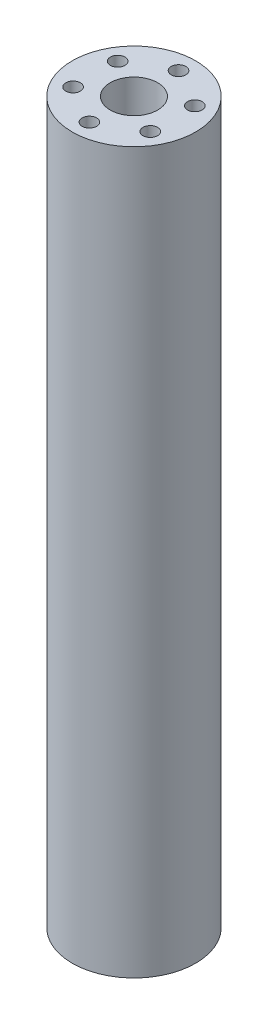
ISO-10303-21;
HEADER;
FILE_DESCRIPTION(('STEP AP214'),'2;1');
FILE_NAME('part.step','',(''),(''),'','','');
FILE_SCHEMA(('AUTOMOTIVE_DESIGN { 1 0 10303 214 1 1 1 1 }'));
ENDSEC;
DATA;
#1=APPLICATION_CONTEXT('core data for automotive mechanical design processes');
#2=APPLICATION_PROTOCOL_DEFINITION('international standard','automotive_design',2000,#1);
#3=PRODUCT_CONTEXT('',#1,'mechanical');
#4=PRODUCT('Part','Part','',(#3));
#5=PRODUCT_RELATED_PRODUCT_CATEGORY('part','',(#4));
#6=PRODUCT_DEFINITION_FORMATION('','',#4);
#7=PRODUCT_DEFINITION_CONTEXT('part definition',#1,'design');
#8=PRODUCT_DEFINITION('design','',#6,#7);
#9=PRODUCT_DEFINITION_SHAPE('','',#8);
#10=(LENGTH_UNIT() NAMED_UNIT(*) SI_UNIT(.MILLI.,.METRE.));
#11=(NAMED_UNIT(*) PLANE_ANGLE_UNIT() SI_UNIT($,.RADIAN.));
#12=(NAMED_UNIT(*) SI_UNIT($,.STERADIAN.) SOLID_ANGLE_UNIT());
#13=UNCERTAINTY_MEASURE_WITH_UNIT(LENGTH_MEASURE(1.E-05),#10,'distance_accuracy_value','');
#14=(GEOMETRIC_REPRESENTATION_CONTEXT(3) GLOBAL_UNCERTAINTY_ASSIGNED_CONTEXT((#13)) GLOBAL_UNIT_ASSIGNED_CONTEXT((#10,
#11,#12)) REPRESENTATION_CONTEXT('',''));
#15=CARTESIAN_POINT('',(0.,0.,0.));
#16=DIRECTION('',(0.,0.,1.));
#17=DIRECTION('',(1.,0.,0.));
#18=AXIS2_PLACEMENT_3D('',#15,#16,#17);
#19=CARTESIAN_POINT('',(0.,210.,0.));
#20=DIRECTION('',(0.,1.,0.));
#21=DIRECTION('',(0.,0.,1.));
#22=AXIS2_PLACEMENT_3D('',#19,#20,#21);
#23=PLANE('',#22);
#24=CARTESIAN_POINT('',(-11.2583302491969,210.,6.50000000000048));
#25=DIRECTION('',(0.,1.,0.));
#26=DIRECTION('',(0.,0.,1.));
#27=AXIS2_PLACEMENT_3D('',#24,#25,#26);
#28=CIRCLE('',#27,2.12769231000105);
#29=CARTESIAN_POINT('',(-11.2583302491969,210.,8.62769231000153));
#30=VERTEX_POINT('',#29);
#31=EDGE_CURVE('E75',#30,#30,#28,.T.);
#32=ORIENTED_EDGE('',*,*,#31,.F.);
#33=EDGE_LOOP('',(#32));
#34=FACE_BOUND('',#33,.T.);
#35=CARTESIAN_POINT('',(11.2583302491985,210.,6.49999999999952));
#36=DIRECTION('',(0.,1.,0.));
#37=DIRECTION('',(0.,0.,1.));
#38=AXIS2_PLACEMENT_3D('',#35,#36,#37);
#39=CIRCLE('',#38,2.12769231000071);
#40=CARTESIAN_POINT('',(11.2583302491985,210.,8.62769231000023));
#41=VERTEX_POINT('',#40);
#42=EDGE_CURVE('E63',#41,#41,#39,.T.);
#43=ORIENTED_EDGE('',*,*,#42,.F.);
#44=EDGE_LOOP('',(#43));
#45=FACE_BOUND('',#44,.T.);
#46=CARTESIAN_POINT('',(0.,210.,0.));
#47=DIRECTION('',(0.,1.,0.));
#48=DIRECTION('',(0.,0.,1.));
#49=AXIS2_PLACEMENT_3D('',#46,#47,#48);
#50=CIRCLE('',#49,6.9156293);
#51=CARTESIAN_POINT('',(0.,210.,6.9156293));
#52=VERTEX_POINT('',#51);
#53=EDGE_CURVE('E51',#52,#52,#50,.T.);
#54=ORIENTED_EDGE('',*,*,#53,.F.);
#55=EDGE_LOOP('',(#54));
#56=FACE_BOUND('',#55,.T.);
#57=CARTESIAN_POINT('',(0.,210.,0.));
#58=DIRECTION('',(0.,1.,0.));
#59=DIRECTION('',(0.,0.,1.));
#60=AXIS2_PLACEMENT_3D('',#57,#58,#59);
#61=CIRCLE('',#60,18.);
#62=CARTESIAN_POINT('',(0.,210.,18.));
#63=VERTEX_POINT('',#62);
#64=EDGE_CURVE('E10',#63,#63,#61,.T.);
#65=ORIENTED_EDGE('',*,*,#64,.T.);
#66=EDGE_LOOP('',(#65));
#67=FACE_BOUND('',#66,.T.);
#68=CARTESIAN_POINT('',(0.,210.,-13.));
#69=DIRECTION('',(0.,1.,0.));
#70=DIRECTION('',(0.,0.,1.));
#71=AXIS2_PLACEMENT_3D('',#68,#69,#70);
#72=CIRCLE('',#71,2.12769231);
#73=CARTESIAN_POINT('',(0.,210.,-10.87230769));
#74=VERTEX_POINT('',#73);
#75=EDGE_CURVE('E46',#74,#74,#72,.T.);
#76=ORIENTED_EDGE('',*,*,#75,.F.);
#77=EDGE_LOOP('',(#76));
#78=FACE_BOUND('',#77,.T.);
#79=CARTESIAN_POINT('',(11.258330249198,210.,-6.50000000000048));
#80=DIRECTION('',(0.,1.,0.));
#81=DIRECTION('',(0.,0.,1.));
#82=AXIS2_PLACEMENT_3D('',#79,#80,#81);
#83=CIRCLE('',#82,2.12769231000016);
#84=CARTESIAN_POINT('',(11.258330249198,210.,-4.37230769000032));
#85=VERTEX_POINT('',#84);
#86=EDGE_CURVE('E57',#85,#85,#83,.T.);
#87=ORIENTED_EDGE('',*,*,#86,.F.);
#88=EDGE_LOOP('',(#87));
#89=FACE_BOUND('',#88,.T.);
#90=CARTESIAN_POINT('',(1.10526258610797E-12,210.,13.));
#91=DIRECTION('',(0.,1.,0.));
#92=DIRECTION('',(0.,0.,1.));
#93=AXIS2_PLACEMENT_3D('',#90,#91,#92);
#94=CIRCLE('',#93,2.12769231000114);
#95=CARTESIAN_POINT('',(1.10526258610797E-12,210.,15.1276923100011));
#96=VERTEX_POINT('',#95);
#97=EDGE_CURVE('E69',#96,#96,#94,.T.);
#98=ORIENTED_EDGE('',*,*,#97,.F.);
#99=EDGE_LOOP('',(#98));
#100=FACE_BOUND('',#99,.T.);
#101=CARTESIAN_POINT('',(-11.2583302491974,210.,-6.49999999999951));
#102=DIRECTION('',(0.,1.,0.));
#103=DIRECTION('',(0.,0.,1.));
#104=AXIS2_PLACEMENT_3D('',#101,#102,#103);
#105=CIRCLE('',#104,2.12769231000056);
#106=CARTESIAN_POINT('',(-11.2583302491974,210.,-4.37230768999895));
#107=VERTEX_POINT('',#106);
#108=EDGE_CURVE('E81',#107,#107,#105,.T.);
#109=ORIENTED_EDGE('',*,*,#108,.F.);
#110=EDGE_LOOP('',(#109));
#111=FACE_BOUND('',#110,.T.);
#112=ADVANCED_FACE('F35',(#34,#45,#56,#67,#78,#89,#100,#111),#23,.T.);
#113=CARTESIAN_POINT('',(0.,0.,0.));
#114=DIRECTION('',(0.,1.,0.));
#115=DIRECTION('',(0.,0.,1.));
#116=AXIS2_PLACEMENT_3D('',#113,#114,#115);
#117=PLANE('',#116);
#118=CARTESIAN_POINT('',(0.,0.,0.));
#119=DIRECTION('',(0.,1.,0.));
#120=DIRECTION('',(0.,0.,1.));
#121=AXIS2_PLACEMENT_3D('',#118,#119,#120);
#122=CIRCLE('',#121,18.);
#123=CARTESIAN_POINT('',(0.,0.,18.));
#124=VERTEX_POINT('',#123);
#125=EDGE_CURVE('E39',#124,#124,#122,.T.);
#126=ORIENTED_EDGE('',*,*,#125,.F.);
#127=EDGE_LOOP('',(#126));
#128=FACE_BOUND('',#127,.T.);
#129=CARTESIAN_POINT('',(0.,0.,-13.));
#130=DIRECTION('',(0.,1.,0.));
#131=DIRECTION('',(0.,0.,1.));
#132=AXIS2_PLACEMENT_3D('',#129,#130,#131);
#133=CIRCLE('',#132,2.12769231);
#134=CARTESIAN_POINT('',(0.,0.,-10.87230769));
#135=VERTEX_POINT('',#134);
#136=EDGE_CURVE('E48',#135,#135,#133,.T.);
#137=ORIENTED_EDGE('',*,*,#136,.T.);
#138=EDGE_LOOP('',(#137));
#139=FACE_BOUND('',#138,.T.);
#140=CARTESIAN_POINT('',(0.,0.,0.));
#141=DIRECTION('',(0.,1.,0.));
#142=DIRECTION('',(0.,0.,1.));
#143=AXIS2_PLACEMENT_3D('',#140,#141,#142);
#144=CIRCLE('',#143,6.9156293);
#145=CARTESIAN_POINT('',(0.,0.,6.9156293));
#146=VERTEX_POINT('',#145);
#147=EDGE_CURVE('E54',#146,#146,#144,.T.);
#148=ORIENTED_EDGE('',*,*,#147,.T.);
#149=EDGE_LOOP('',(#148));
#150=FACE_BOUND('',#149,.T.);
#151=CARTESIAN_POINT('',(11.258330249198,0.,-6.50000000000048));
#152=DIRECTION('',(0.,1.,0.));
#153=DIRECTION('',(0.,0.,1.));
#154=AXIS2_PLACEMENT_3D('',#151,#152,#153);
#155=CIRCLE('',#154,2.12769231000016);
#156=CARTESIAN_POINT('',(11.258330249198,0.,-4.37230769000032));
#157=VERTEX_POINT('',#156);
#158=EDGE_CURVE('E60',#157,#157,#155,.T.);
#159=ORIENTED_EDGE('',*,*,#158,.T.);
#160=EDGE_LOOP('',(#159));
#161=FACE_BOUND('',#160,.T.);
#162=CARTESIAN_POINT('',(11.2583302491985,0.,6.49999999999952));
#163=DIRECTION('',(0.,1.,0.));
#164=DIRECTION('',(0.,0.,1.));
#165=AXIS2_PLACEMENT_3D('',#162,#163,#164);
#166=CIRCLE('',#165,2.12769231000071);
#167=CARTESIAN_POINT('',(11.2583302491985,0.,8.62769231000023));
#168=VERTEX_POINT('',#167);
#169=EDGE_CURVE('E66',#168,#168,#166,.T.);
#170=ORIENTED_EDGE('',*,*,#169,.T.);
#171=EDGE_LOOP('',(#170));
#172=FACE_BOUND('',#171,.T.);
#173=CARTESIAN_POINT('',(1.10526258610797E-12,0.,13.));
#174=DIRECTION('',(0.,1.,0.));
#175=DIRECTION('',(0.,0.,1.));
#176=AXIS2_PLACEMENT_3D('',#173,#174,#175);
#177=CIRCLE('',#176,2.12769231000114);
#178=CARTESIAN_POINT('',(1.10526258610797E-12,0.,15.1276923100011));
#179=VERTEX_POINT('',#178);
#180=EDGE_CURVE('E72',#179,#179,#177,.T.);
#181=ORIENTED_EDGE('',*,*,#180,.T.);
#182=EDGE_LOOP('',(#181));
#183=FACE_BOUND('',#182,.T.);
#184=CARTESIAN_POINT('',(-11.2583302491969,0.,6.50000000000048));
#185=DIRECTION('',(0.,1.,0.));
#186=DIRECTION('',(0.,0.,1.));
#187=AXIS2_PLACEMENT_3D('',#184,#185,#186);
#188=CIRCLE('',#187,2.12769231000105);
#189=CARTESIAN_POINT('',(-11.2583302491969,0.,8.62769231000153));
#190=VERTEX_POINT('',#189);
#191=EDGE_CURVE('E78',#190,#190,#188,.T.);
#192=ORIENTED_EDGE('',*,*,#191,.T.);
#193=EDGE_LOOP('',(#192));
#194=FACE_BOUND('',#193,.T.);
#195=CARTESIAN_POINT('',(-11.2583302491974,0.,-6.49999999999951));
#196=DIRECTION('',(0.,1.,0.));
#197=DIRECTION('',(0.,0.,1.));
#198=AXIS2_PLACEMENT_3D('',#195,#196,#197);
#199=CIRCLE('',#198,2.12769231000056);
#200=CARTESIAN_POINT('',(-11.2583302491974,0.,-4.37230768999895));
#201=VERTEX_POINT('',#200);
#202=EDGE_CURVE('E84',#201,#201,#199,.T.);
#203=ORIENTED_EDGE('',*,*,#202,.T.);
#204=EDGE_LOOP('',(#203));
#205=FACE_BOUND('',#204,.T.);
#206=ADVANCED_FACE('F94',(#128,#139,#150,#161,#172,#183,#194,#205),#117,.F.);
#207=CARTESIAN_POINT('',(0.,210.,0.));
#208=DIRECTION('',(0.,-1.,0.));
#209=DIRECTION('',(0.,0.,-1.));
#210=AXIS2_PLACEMENT_3D('',#207,#208,#209);
#211=CYLINDRICAL_SURFACE('',#210,18.);
#212=ORIENTED_EDGE('',*,*,#64,.F.);
#213=EDGE_LOOP('',(#212));
#214=FACE_BOUND('',#213,.T.);
#215=ORIENTED_EDGE('',*,*,#125,.T.);
#216=EDGE_LOOP('',(#215));
#217=FACE_BOUND('',#216,.T.);
#218=ADVANCED_FACE('F37',(#214,#217),#211,.T.);
#219=CARTESIAN_POINT('',(0.,210.,-13.));
#220=DIRECTION('',(0.,-1.,0.));
#221=DIRECTION('',(0.,0.,-1.));
#222=AXIS2_PLACEMENT_3D('',#219,#220,#221);
#223=CYLINDRICAL_SURFACE('',#222,2.12769231);
#224=ORIENTED_EDGE('',*,*,#75,.T.);
#225=EDGE_LOOP('',(#224));
#226=FACE_BOUND('',#225,.T.);
#227=ORIENTED_EDGE('',*,*,#136,.F.);
#228=EDGE_LOOP('',(#227));
#229=FACE_BOUND('',#228,.T.);
#230=ADVANCED_FACE('F104',(#226,#229),#223,.F.);
#231=CARTESIAN_POINT('',(0.,210.,0.));
#232=DIRECTION('',(0.,-1.,0.));
#233=DIRECTION('',(0.,0.,-1.));
#234=AXIS2_PLACEMENT_3D('',#231,#232,#233);
#235=CYLINDRICAL_SURFACE('',#234,6.9156293);
#236=ORIENTED_EDGE('',*,*,#53,.T.);
#237=EDGE_LOOP('',(#236));
#238=FACE_BOUND('',#237,.T.);
#239=ORIENTED_EDGE('',*,*,#147,.F.);
#240=EDGE_LOOP('',(#239));
#241=FACE_BOUND('',#240,.T.);
#242=ADVANCED_FACE('F107',(#238,#241),#235,.F.);
#243=CARTESIAN_POINT('',(11.258330249198,210.,-6.50000000000048));
#244=DIRECTION('',(0.,-1.,0.));
#245=DIRECTION('',(0.,0.,-1.));
#246=AXIS2_PLACEMENT_3D('',#243,#244,#245);
#247=CYLINDRICAL_SURFACE('',#246,2.12769231000016);
#248=ORIENTED_EDGE('',*,*,#86,.T.);
#249=EDGE_LOOP('',(#248));
#250=FACE_BOUND('',#249,.T.);
#251=ORIENTED_EDGE('',*,*,#158,.F.);
#252=EDGE_LOOP('',(#251));
#253=FACE_BOUND('',#252,.T.);
#254=ADVANCED_FACE('F111',(#250,#253),#247,.F.);
#255=CARTESIAN_POINT('',(11.2583302491985,210.,6.49999999999952));
#256=DIRECTION('',(0.,-1.,0.));
#257=DIRECTION('',(0.,0.,-1.));
#258=AXIS2_PLACEMENT_3D('',#255,#256,#257);
#259=CYLINDRICAL_SURFACE('',#258,2.12769231000071);
#260=ORIENTED_EDGE('',*,*,#42,.T.);
#261=EDGE_LOOP('',(#260));
#262=FACE_BOUND('',#261,.T.);
#263=ORIENTED_EDGE('',*,*,#169,.F.);
#264=EDGE_LOOP('',(#263));
#265=FACE_BOUND('',#264,.T.);
#266=ADVANCED_FACE('F115',(#262,#265),#259,.F.);
#267=CARTESIAN_POINT('',(1.10526258610797E-12,210.,13.));
#268=DIRECTION('',(0.,-1.,0.));
#269=DIRECTION('',(0.,0.,-1.));
#270=AXIS2_PLACEMENT_3D('',#267,#268,#269);
#271=CYLINDRICAL_SURFACE('',#270,2.12769231000114);
#272=ORIENTED_EDGE('',*,*,#97,.T.);
#273=EDGE_LOOP('',(#272));
#274=FACE_BOUND('',#273,.T.);
#275=ORIENTED_EDGE('',*,*,#180,.F.);
#276=EDGE_LOOP('',(#275));
#277=FACE_BOUND('',#276,.T.);
#278=ADVANCED_FACE('F119',(#274,#277),#271,.F.);
#279=CARTESIAN_POINT('',(-11.2583302491969,210.,6.50000000000048));
#280=DIRECTION('',(0.,-1.,0.));
#281=DIRECTION('',(0.,0.,-1.));
#282=AXIS2_PLACEMENT_3D('',#279,#280,#281);
#283=CYLINDRICAL_SURFACE('',#282,2.12769231000105);
#284=ORIENTED_EDGE('',*,*,#31,.T.);
#285=EDGE_LOOP('',(#284));
#286=FACE_BOUND('',#285,.T.);
#287=ORIENTED_EDGE('',*,*,#191,.F.);
#288=EDGE_LOOP('',(#287));
#289=FACE_BOUND('',#288,.T.);
#290=ADVANCED_FACE('F123',(#286,#289),#283,.F.);
#291=CARTESIAN_POINT('',(-11.2583302491974,210.,-6.49999999999951));
#292=DIRECTION('',(0.,-1.,0.));
#293=DIRECTION('',(0.,0.,-1.));
#294=AXIS2_PLACEMENT_3D('',#291,#292,#293);
#295=CYLINDRICAL_SURFACE('',#294,2.12769231000056);
#296=ORIENTED_EDGE('',*,*,#108,.T.);
#297=EDGE_LOOP('',(#296));
#298=FACE_BOUND('',#297,.T.);
#299=ORIENTED_EDGE('',*,*,#202,.F.);
#300=EDGE_LOOP('',(#299));
#301=FACE_BOUND('',#300,.T.);
#302=ADVANCED_FACE('F90',(#298,#301),#295,.F.);
#303=CLOSED_SHELL('',(#112,#206,#218,#230,#242,#254,#266,#278,#290,#302));
#304=MANIFOLD_SOLID_BREP('B2',#303);
#305=ADVANCED_BREP_SHAPE_REPRESENTATION('',(#18,#304),#14);
#306=SHAPE_DEFINITION_REPRESENTATION(#9,#305);
ENDSEC;
END-ISO-10303-21;
